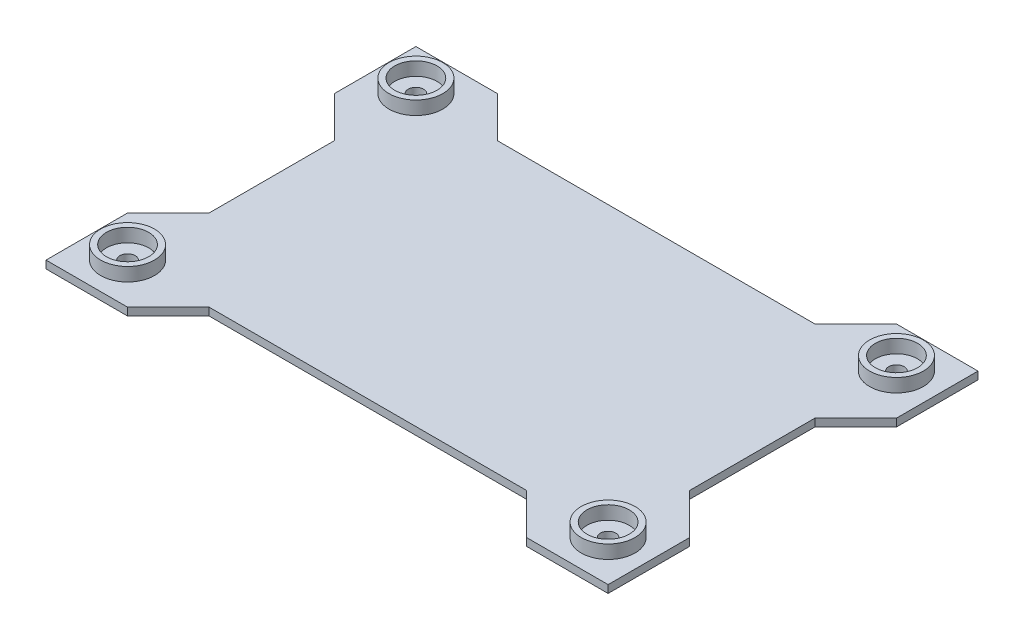
ISO-10303-21;
HEADER;
FILE_DESCRIPTION(('STEP AP214'),'2;1');
FILE_NAME('part.step','',(''),(''),'','','');
FILE_SCHEMA(('AUTOMOTIVE_DESIGN { 1 0 10303 214 1 1 1 1 }'));
ENDSEC;
DATA;
#1=APPLICATION_CONTEXT('core data for automotive mechanical design processes');
#2=APPLICATION_PROTOCOL_DEFINITION('international standard','automotive_design',2000,#1);
#3=PRODUCT_CONTEXT('',#1,'mechanical');
#4=PRODUCT('Part','Part','',(#3));
#5=PRODUCT_RELATED_PRODUCT_CATEGORY('part','',(#4));
#6=PRODUCT_DEFINITION_FORMATION('','',#4);
#7=PRODUCT_DEFINITION_CONTEXT('part definition',#1,'design');
#8=PRODUCT_DEFINITION('design','',#6,#7);
#9=PRODUCT_DEFINITION_SHAPE('','',#8);
#10=(LENGTH_UNIT() NAMED_UNIT(*) SI_UNIT(.MILLI.,.METRE.));
#11=(NAMED_UNIT(*) PLANE_ANGLE_UNIT() SI_UNIT($,.RADIAN.));
#12=(NAMED_UNIT(*) SI_UNIT($,.STERADIAN.) SOLID_ANGLE_UNIT());
#13=UNCERTAINTY_MEASURE_WITH_UNIT(LENGTH_MEASURE(1.E-05),#10,'distance_accuracy_value','');
#14=(GEOMETRIC_REPRESENTATION_CONTEXT(3) GLOBAL_UNCERTAINTY_ASSIGNED_CONTEXT((#13)) GLOBAL_UNIT_ASSIGNED_CONTEXT((#10,
#11,#12)) REPRESENTATION_CONTEXT('',''));
#15=CARTESIAN_POINT('',(0.,0.,0.));
#16=DIRECTION('',(0.,0.,1.));
#17=DIRECTION('',(1.,0.,0.));
#18=AXIS2_PLACEMENT_3D('',#15,#16,#17);
#19=CARTESIAN_POINT('',(0.,4.,0.));
#20=DIRECTION('',(0.,1.,0.));
#21=DIRECTION('',(0.,0.,1.));
#22=AXIS2_PLACEMENT_3D('',#19,#20,#21);
#23=PLANE('',#22);
#24=CARTESIAN_POINT('',(125.,4.,75.0000000000001));
#25=DIRECTION('',(0.,1.,0.));
#26=DIRECTION('',(0.,0.,-1.));
#27=AXIS2_PLACEMENT_3D('',#24,#25,#26);
#28=CIRCLE('',#27,4.00000000000001);
#29=CARTESIAN_POINT('',(125.,4.,71.0000000000001));
#30=VERTEX_POINT('',#29);
#31=EDGE_CURVE('E209',#30,#30,#28,.T.);
#32=ORIENTED_EDGE('',*,*,#31,.F.);
#33=EDGE_LOOP('',(#32));
#34=FACE_BOUND('',#33,.T.);
#35=CARTESIAN_POINT('',(125.,4.,75.0000000000001));
#36=DIRECTION('',(0.,1.,0.));
#37=DIRECTION('',(0.,0.,1.));
#38=AXIS2_PLACEMENT_3D('',#35,#36,#37);
#39=CIRCLE('',#38,11.);
#40=CARTESIAN_POINT('',(125.,4.,86.0000000000001));
#41=VERTEX_POINT('',#40);
#42=EDGE_CURVE('E11',#41,#41,#39,.F.);
#43=ORIENTED_EDGE('',*,*,#42,.F.);
#44=EDGE_LOOP('',(#43));
#45=FACE_BOUND('',#44,.T.);
#46=ADVANCED_FACE('F39',(#34,#45),#23,.T.);
#47=CARTESIAN_POINT('',(-125.,4.,75.0000000000001));
#48=DIRECTION('',(0.,-1.,0.));
#49=DIRECTION('',(0.,0.,-1.));
#50=AXIS2_PLACEMENT_3D('',#47,#48,#49);
#51=CIRCLE('',#50,4.00000000000001);
#52=CARTESIAN_POINT('',(-125.,4.,71.0000000000001));
#53=VERTEX_POINT('',#52);
#54=EDGE_CURVE('E244',#53,#53,#51,.T.);
#55=ORIENTED_EDGE('',*,*,#54,.T.);
#56=EDGE_LOOP('',(#55));
#57=FACE_BOUND('',#56,.T.);
#58=CARTESIAN_POINT('',(-125.,4.,75.0000000000001));
#59=DIRECTION('',(0.,-1.,0.));
#60=DIRECTION('',(0.,0.,-1.));
#61=AXIS2_PLACEMENT_3D('',#58,#59,#60);
#62=CIRCLE('',#61,11.);
#63=CARTESIAN_POINT('',(-125.,4.,64.0000000000001));
#64=VERTEX_POINT('',#63);
#65=EDGE_CURVE('E232',#64,#64,#62,.T.);
#66=ORIENTED_EDGE('',*,*,#65,.F.);
#67=EDGE_LOOP('',(#66));
#68=FACE_BOUND('',#67,.T.);
#69=ADVANCED_FACE('F499',(#57,#68),#23,.T.);
#70=CARTESIAN_POINT('',(-125.,4.,-75.));
#71=DIRECTION('',(1.,0.,0.));
#72=DIRECTION('',(0.,0.,-1.));
#73=AXIS2_PLACEMENT_3D('',#70,#71,#72);
#74=PLANE('',#73);
#75=DIRECTION('',(0.,1.,0.));
#76=VECTOR('',#75,1.);
#77=CARTESIAN_POINT('',(-125.,-89.9999999999999,32.5735931288077));
#78=LINE('',#77,#76);
#79=CARTESIAN_POINT('',(-125.,0.,32.5735931288077));
#80=VERTEX_POINT('',#79);
#81=CARTESIAN_POINT('',(-125.,4.,32.5735931288077));
#82=VERTEX_POINT('',#81);
#83=EDGE_CURVE('E286',#80,#82,#78,.T.);
#84=ORIENTED_EDGE('',*,*,#83,.T.);
#85=DIRECTION('',(0.,0.,1.));
#86=VECTOR('',#85,1.);
#87=CARTESIAN_POINT('',(-125.,4.,-75.));
#88=LINE('',#87,#86);
#89=CARTESIAN_POINT('',(-125.,4.,-32.5735931288077));
#90=VERTEX_POINT('',#89);
#91=EDGE_CURVE('E441',#90,#82,#88,.T.);
#92=ORIENTED_EDGE('',*,*,#91,.F.);
#93=DIRECTION('',(0.,1.,0.));
#94=VECTOR('',#93,1.);
#95=CARTESIAN_POINT('',(-125.,-89.9999999999999,-32.5735931288077));
#96=LINE('',#95,#94);
#97=CARTESIAN_POINT('',(-125.,0.,-32.5735931288077));
#98=VERTEX_POINT('',#97);
#99=EDGE_CURVE('E426',#98,#90,#96,.T.);
#100=ORIENTED_EDGE('',*,*,#99,.F.);
#101=DIRECTION('',(0.,0.,1.));
#102=VECTOR('',#101,1.);
#103=CARTESIAN_POINT('',(-125.,0.,-75.));
#104=LINE('',#103,#102);
#105=EDGE_CURVE('E454',#98,#80,#104,.T.);
#106=ORIENTED_EDGE('',*,*,#105,.T.);
#107=EDGE_LOOP('',(#84,#92,#100,#106));
#108=FACE_BOUND('',#107,.T.);
#109=ADVANCED_FACE('F504',(#108),#74,.F.);
#110=CARTESIAN_POINT('',(-125.,4.,75.));
#111=DIRECTION('',(0.,0.,-1.));
#112=DIRECTION('',(-1.,0.,0.));
#113=AXIS2_PLACEMENT_3D('',#110,#111,#112);
#114=PLANE('',#113);
#115=DIRECTION('',(1.,0.,0.));
#116=VECTOR('',#115,1.);
#117=CARTESIAN_POINT('',(-125.,0.,75.));
#118=LINE('',#117,#116);
#119=CARTESIAN_POINT('',(-82.5735931288068,0.,75.));
#120=VERTEX_POINT('',#119);
#121=CARTESIAN_POINT('',(82.5735931288068,0.,75.));
#122=VERTEX_POINT('',#121);
#123=EDGE_CURVE('E438',#120,#122,#118,.T.);
#124=ORIENTED_EDGE('',*,*,#123,.T.);
#125=DIRECTION('',(0.,1.,0.));
#126=VECTOR('',#125,1.);
#127=CARTESIAN_POINT('',(82.5735931288068,-89.9999999999999,75.));
#128=LINE('',#127,#126);
#129=CARTESIAN_POINT('',(82.5735931288068,4.,75.));
#130=VERTEX_POINT('',#129);
#131=EDGE_CURVE('E63',#122,#130,#128,.T.);
#132=ORIENTED_EDGE('',*,*,#131,.T.);
#133=DIRECTION('',(1.,0.,0.));
#134=VECTOR('',#133,1.);
#135=CARTESIAN_POINT('',(-125.,4.,75.));
#136=LINE('',#135,#134);
#137=CARTESIAN_POINT('',(-82.5735931288068,4.,75.));
#138=VERTEX_POINT('',#137);
#139=EDGE_CURVE('E445',#138,#130,#136,.T.);
#140=ORIENTED_EDGE('',*,*,#139,.F.);
#141=DIRECTION('',(0.,1.,0.));
#142=VECTOR('',#141,1.);
#143=CARTESIAN_POINT('',(-82.5735931288068,-89.9999999999999,75.));
#144=LINE('',#143,#142);
#145=EDGE_CURVE('E289',#120,#138,#144,.T.);
#146=ORIENTED_EDGE('',*,*,#145,.F.);
#147=EDGE_LOOP('',(#124,#132,#140,#146));
#148=FACE_BOUND('',#147,.T.);
#149=ADVANCED_FACE('F516',(#148),#114,.F.);
#150=CARTESIAN_POINT('',(125.,4.,-75.0000000000001));
#151=DIRECTION('',(0.,-1.,0.));
#152=DIRECTION('',(0.,0.,1.));
#153=AXIS2_PLACEMENT_3D('',#150,#151,#152);
#154=CIRCLE('',#153,4.00000000000001);
#155=CARTESIAN_POINT('',(125.,4.,-71.0000000000001));
#156=VERTEX_POINT('',#155);
#157=EDGE_CURVE('E312',#156,#156,#154,.T.);
#158=ORIENTED_EDGE('',*,*,#157,.T.);
#159=EDGE_LOOP('',(#158));
#160=FACE_BOUND('',#159,.T.);
#161=CARTESIAN_POINT('',(125.,4.,-75.0000000000001));
#162=DIRECTION('',(0.,-1.,0.));
#163=DIRECTION('',(0.,0.,1.));
#164=AXIS2_PLACEMENT_3D('',#161,#162,#163);
#165=CIRCLE('',#164,11.);
#166=CARTESIAN_POINT('',(125.,4.,-64.0000000000001));
#167=VERTEX_POINT('',#166);
#168=EDGE_CURVE('E266',#167,#167,#165,.T.);
#169=ORIENTED_EDGE('',*,*,#168,.F.);
#170=EDGE_LOOP('',(#169));
#171=FACE_BOUND('',#170,.T.);
#172=ADVANCED_FACE('F506',(#160,#171),#23,.T.);
#173=CARTESIAN_POINT('',(125.,4.,-75.));
#174=DIRECTION('',(-1.,0.,0.));
#175=DIRECTION('',(0.,0.,1.));
#176=AXIS2_PLACEMENT_3D('',#173,#174,#175);
#177=PLANE('',#176);
#178=DIRECTION('',(0.,0.,-1.));
#179=VECTOR('',#178,1.);
#180=CARTESIAN_POINT('',(125.,4.,-75.));
#181=LINE('',#180,#179);
#182=CARTESIAN_POINT('',(125.,4.,32.5735931288077));
#183=VERTEX_POINT('',#182);
#184=CARTESIAN_POINT('',(125.,4.,-32.5735931288077));
#185=VERTEX_POINT('',#184);
#186=EDGE_CURVE('E55',#183,#185,#181,.T.);
#187=ORIENTED_EDGE('',*,*,#186,.F.);
#188=DIRECTION('',(0.,1.,0.));
#189=VECTOR('',#188,1.);
#190=CARTESIAN_POINT('',(125.,-89.9999999999999,32.5735931288077));
#191=LINE('',#190,#189);
#192=CARTESIAN_POINT('',(125.,0.,32.5735931288077));
#193=VERTEX_POINT('',#192);
#194=EDGE_CURVE('E190',#193,#183,#191,.T.);
#195=ORIENTED_EDGE('',*,*,#194,.F.);
#196=DIRECTION('',(0.,0.,-1.));
#197=VECTOR('',#196,1.);
#198=CARTESIAN_POINT('',(125.,0.,-75.));
#199=LINE('',#198,#197);
#200=CARTESIAN_POINT('',(125.,0.,-32.5735931288077));
#201=VERTEX_POINT('',#200);
#202=EDGE_CURVE('E434',#193,#201,#199,.T.);
#203=ORIENTED_EDGE('',*,*,#202,.T.);
#204=DIRECTION('',(0.,1.,0.));
#205=VECTOR('',#204,1.);
#206=CARTESIAN_POINT('',(125.,-89.9999999999999,-32.5735931288077));
#207=LINE('',#206,#205);
#208=EDGE_CURVE('E354',#201,#185,#207,.T.);
#209=ORIENTED_EDGE('',*,*,#208,.T.);
#210=EDGE_LOOP('',(#187,#195,#203,#209));
#211=FACE_BOUND('',#210,.T.);
#212=ADVANCED_FACE('F41',(#211),#177,.F.);
#213=CARTESIAN_POINT('',(-125.,4.,-75.));
#214=DIRECTION('',(0.,0.,1.));
#215=DIRECTION('',(1.,0.,0.));
#216=AXIS2_PLACEMENT_3D('',#213,#214,#215);
#217=PLANE('',#216);
#218=DIRECTION('',(0.,1.,0.));
#219=VECTOR('',#218,1.);
#220=CARTESIAN_POINT('',(82.5735931288068,-89.9999999999999,-75.));
#221=LINE('',#220,#219);
#222=CARTESIAN_POINT('',(82.5735931288068,0.,-75.));
#223=VERTEX_POINT('',#222);
#224=CARTESIAN_POINT('',(82.5735931288068,4.,-75.));
#225=VERTEX_POINT('',#224);
#226=EDGE_CURVE('E357',#223,#225,#221,.T.);
#227=ORIENTED_EDGE('',*,*,#226,.F.);
#228=DIRECTION('',(-1.,0.,0.));
#229=VECTOR('',#228,1.);
#230=CARTESIAN_POINT('',(-125.,0.,-75.));
#231=LINE('',#230,#229);
#232=CARTESIAN_POINT('',(-82.5735931288068,0.,-75.));
#233=VERTEX_POINT('',#232);
#234=EDGE_CURVE('E451',#223,#233,#231,.T.);
#235=ORIENTED_EDGE('',*,*,#234,.T.);
#236=DIRECTION('',(0.,1.,0.));
#237=VECTOR('',#236,1.);
#238=CARTESIAN_POINT('',(-82.5735931288068,-89.9999999999999,-75.));
#239=LINE('',#238,#237);
#240=CARTESIAN_POINT('',(-82.5735931288068,4.,-75.));
#241=VERTEX_POINT('',#240);
#242=EDGE_CURVE('E422',#233,#241,#239,.T.);
#243=ORIENTED_EDGE('',*,*,#242,.T.);
#244=DIRECTION('',(-1.,0.,0.));
#245=VECTOR('',#244,1.);
#246=CARTESIAN_POINT('',(-125.,4.,-75.));
#247=LINE('',#246,#245);
#248=EDGE_CURVE('E437',#225,#241,#247,.T.);
#249=ORIENTED_EDGE('',*,*,#248,.F.);
#250=EDGE_LOOP('',(#227,#235,#243,#249));
#251=FACE_BOUND('',#250,.T.);
#252=ADVANCED_FACE('F521',(#251),#217,.F.);
#253=CARTESIAN_POINT('',(-125.,4.,-75.0000000000001));
#254=DIRECTION('',(0.,1.,0.));
#255=DIRECTION('',(0.,0.,1.));
#256=AXIS2_PLACEMENT_3D('',#253,#254,#255);
#257=CIRCLE('',#256,4.00000000000001);
#258=CARTESIAN_POINT('',(-125.,4.,-71.0000000000001));
#259=VERTEX_POINT('',#258);
#260=EDGE_CURVE('E377',#259,#259,#257,.T.);
#261=ORIENTED_EDGE('',*,*,#260,.F.);
#262=EDGE_LOOP('',(#261));
#263=FACE_BOUND('',#262,.T.);
#264=CARTESIAN_POINT('',(-125.,4.,-75.0000000000001));
#265=DIRECTION('',(0.,1.,0.));
#266=DIRECTION('',(0.,0.,1.));
#267=AXIS2_PLACEMENT_3D('',#264,#265,#266);
#268=CIRCLE('',#267,11.);
#269=CARTESIAN_POINT('',(-125.,4.,-64.0000000000001));
#270=VERTEX_POINT('',#269);
#271=EDGE_CURVE('E448',#270,#270,#268,.F.);
#272=ORIENTED_EDGE('',*,*,#271,.F.);
#273=EDGE_LOOP('',(#272));
#274=FACE_BOUND('',#273,.T.);
#275=ADVANCED_FACE('F473',(#263,#274),#23,.T.);
#276=CARTESIAN_POINT('',(125.,4.,75.0000000000001));
#277=DIRECTION('',(0.,1.,0.));
#278=DIRECTION('',(0.,0.,-1.));
#279=AXIS2_PLACEMENT_3D('',#276,#277,#278);
#280=CIRCLE('',#279,14.);
#281=CARTESIAN_POINT('',(125.,4.,61.0000000000001));
#282=VERTEX_POINT('',#281);
#283=EDGE_CURVE('E605',#282,#282,#280,.T.);
#284=ORIENTED_EDGE('',*,*,#283,.F.);
#285=EDGE_LOOP('',(#284));
#286=FACE_BOUND('',#285,.T.);
#287=ORIENTED_EDGE('',*,*,#139,.T.);
#288=DIRECTION('',(0.707106781186549,0.,0.707106781186546));
#289=VECTOR('',#288,1.);
#290=CARTESIAN_POINT('',(103.786796564403,4.,96.2132034355965));
#291=LINE('',#290,#289);
#292=CARTESIAN_POINT('',(103.786796564403,4.,96.2132034355965));
#293=VERTEX_POINT('',#292);
#294=EDGE_CURVE('E198',#130,#293,#291,.T.);
#295=ORIENTED_EDGE('',*,*,#294,.T.);
#296=DIRECTION('',(1.,0.,0.));
#297=VECTOR('',#296,1.);
#298=CARTESIAN_POINT('',(146.213203435596,4.,96.2132034355965));
#299=LINE('',#298,#297);
#300=CARTESIAN_POINT('',(146.213203435596,4.,96.2132034355965));
#301=VERTEX_POINT('',#300);
#302=EDGE_CURVE('E191',#293,#301,#299,.T.);
#303=ORIENTED_EDGE('',*,*,#302,.T.);
#304=DIRECTION('',(0.,0.,-1.));
#305=VECTOR('',#304,1.);
#306=CARTESIAN_POINT('',(146.213203435596,4.,96.2132034355965));
#307=LINE('',#306,#305);
#308=CARTESIAN_POINT('',(146.213203435596,4.,53.7867965644037));
#309=VERTEX_POINT('',#308);
#310=EDGE_CURVE('E184',#301,#309,#307,.T.);
#311=ORIENTED_EDGE('',*,*,#310,.T.);
#312=DIRECTION('',(-0.707106781186551,0.,-0.707106781186543));
#313=VECTOR('',#312,1.);
#314=CARTESIAN_POINT('',(146.213203435596,4.,53.7867965644037));
#315=LINE('',#314,#313);
#316=EDGE_CURVE('E194',#309,#183,#315,.T.);
#317=ORIENTED_EDGE('',*,*,#316,.T.);
#318=ORIENTED_EDGE('',*,*,#186,.T.);
#319=DIRECTION('',(-0.707106781186551,0.,0.707106781186543));
#320=VECTOR('',#319,1.);
#321=CARTESIAN_POINT('',(146.213203435596,4.,-53.7867965644037));
#322=LINE('',#321,#320);
#323=CARTESIAN_POINT('',(146.213203435596,4.,-53.7867965644037));
#324=VERTEX_POINT('',#323);
#325=EDGE_CURVE('E346',#324,#185,#322,.T.);
#326=ORIENTED_EDGE('',*,*,#325,.F.);
#327=DIRECTION('',(0.,0.,1.));
#328=VECTOR('',#327,1.);
#329=CARTESIAN_POINT('',(146.213203435596,4.,-96.2132034355965));
#330=LINE('',#329,#328);
#331=CARTESIAN_POINT('',(146.213203435596,4.,-96.2132034355965));
#332=VERTEX_POINT('',#331);
#333=EDGE_CURVE('E317',#332,#324,#330,.T.);
#334=ORIENTED_EDGE('',*,*,#333,.F.);
#335=DIRECTION('',(1.,0.,0.));
#336=VECTOR('',#335,1.);
#337=CARTESIAN_POINT('',(146.213203435596,4.,-96.2132034355965));
#338=LINE('',#337,#336);
#339=CARTESIAN_POINT('',(103.786796564403,4.,-96.2132034355965));
#340=VERTEX_POINT('',#339);
#341=EDGE_CURVE('E338',#340,#332,#338,.T.);
#342=ORIENTED_EDGE('',*,*,#341,.F.);
#343=DIRECTION('',(0.707106781186549,0.,-0.707106781186546));
#344=VECTOR('',#343,1.);
#345=CARTESIAN_POINT('',(103.786796564403,4.,-96.2132034355965));
#346=LINE('',#345,#344);
#347=EDGE_CURVE('E342',#225,#340,#346,.T.);
#348=ORIENTED_EDGE('',*,*,#347,.F.);
#349=ORIENTED_EDGE('',*,*,#248,.T.);
#350=DIRECTION('',(-0.707106781186549,0.,-0.707106781186546));
#351=VECTOR('',#350,1.);
#352=CARTESIAN_POINT('',(-103.786796564403,4.,-96.2132034355965));
#353=LINE('',#352,#351);
#354=CARTESIAN_POINT('',(-103.786796564403,4.,-96.2132034355965));
#355=VERTEX_POINT('',#354);
#356=EDGE_CURVE('E408',#241,#355,#353,.T.);
#357=ORIENTED_EDGE('',*,*,#356,.T.);
#358=DIRECTION('',(-1.,0.,0.));
#359=VECTOR('',#358,1.);
#360=CARTESIAN_POINT('',(-146.213203435596,4.,-96.2132034355965));
#361=LINE('',#360,#359);
#362=CARTESIAN_POINT('',(-146.213203435596,4.,-96.2132034355965));
#363=VERTEX_POINT('',#362);
#364=EDGE_CURVE('E412',#355,#363,#361,.T.);
#365=ORIENTED_EDGE('',*,*,#364,.T.);
#366=DIRECTION('',(0.,0.,1.));
#367=VECTOR('',#366,1.);
#368=CARTESIAN_POINT('',(-146.213203435596,4.,-96.2132034355965));
#369=LINE('',#368,#367);
#370=CARTESIAN_POINT('',(-146.213203435596,4.,-53.7867965644037));
#371=VERTEX_POINT('',#370);
#372=EDGE_CURVE('E385',#363,#371,#369,.T.);
#373=ORIENTED_EDGE('',*,*,#372,.T.);
#374=DIRECTION('',(0.707106781186551,0.,0.707106781186543));
#375=VECTOR('',#374,1.);
#376=CARTESIAN_POINT('',(-146.213203435596,4.,-53.7867965644037));
#377=LINE('',#376,#375);
#378=EDGE_CURVE('E404',#371,#90,#377,.T.);
#379=ORIENTED_EDGE('',*,*,#378,.T.);
#380=ORIENTED_EDGE('',*,*,#91,.T.);
#381=DIRECTION('',(0.707106781186551,0.,-0.707106781186543));
#382=VECTOR('',#381,1.);
#383=CARTESIAN_POINT('',(-146.213203435596,4.,53.7867965644037));
#384=LINE('',#383,#382);
#385=CARTESIAN_POINT('',(-146.213203435596,4.,53.7867965644037));
#386=VERTEX_POINT('',#385);
#387=EDGE_CURVE('E278',#386,#82,#384,.T.);
#388=ORIENTED_EDGE('',*,*,#387,.F.);
#389=DIRECTION('',(0.,0.,-1.));
#390=VECTOR('',#389,1.);
#391=CARTESIAN_POINT('',(-146.213203435596,4.,96.2132034355965));
#392=LINE('',#391,#390);
#393=CARTESIAN_POINT('',(-146.213203435596,4.,96.2132034355965));
#394=VERTEX_POINT('',#393);
#395=EDGE_CURVE('E249',#394,#386,#392,.T.);
#396=ORIENTED_EDGE('',*,*,#395,.F.);
#397=DIRECTION('',(-1.,0.,0.));
#398=VECTOR('',#397,1.);
#399=CARTESIAN_POINT('',(-146.213203435596,4.,96.2132034355965));
#400=LINE('',#399,#398);
#401=CARTESIAN_POINT('',(-103.786796564403,4.,96.2132034355965));
#402=VERTEX_POINT('',#401);
#403=EDGE_CURVE('E270',#402,#394,#400,.T.);
#404=ORIENTED_EDGE('',*,*,#403,.F.);
#405=DIRECTION('',(-0.707106781186549,0.,0.707106781186546));
#406=VECTOR('',#405,1.);
#407=CARTESIAN_POINT('',(-103.786796564403,4.,96.2132034355965));
#408=LINE('',#407,#406);
#409=EDGE_CURVE('E274',#138,#402,#408,.T.);
#410=ORIENTED_EDGE('',*,*,#409,.F.);
#411=EDGE_LOOP('',(#287,#295,#303,#311,#317,#318,#326,#334,#342,#348,#349,#357,#365,#373,#379,
#380,#388,#396,#404,#410));
#412=FACE_BOUND('',#411,.T.);
#413=CARTESIAN_POINT('',(-125.,4.,75.0000000000001));
#414=DIRECTION('',(0.,1.,0.));
#415=DIRECTION('',(0.,0.,1.));
#416=AXIS2_PLACEMENT_3D('',#413,#414,#415);
#417=CIRCLE('',#416,14.);
#418=CARTESIAN_POINT('',(-125.,4.,89.0000000000001));
#419=VERTEX_POINT('',#418);
#420=EDGE_CURVE('E48',#419,#419,#417,.T.);
#421=ORIENTED_EDGE('',*,*,#420,.F.);
#422=EDGE_LOOP('',(#421));
#423=FACE_BOUND('',#422,.T.);
#424=CARTESIAN_POINT('',(125.,4.,-75.0000000000001));
#425=DIRECTION('',(0.,1.,0.));
#426=DIRECTION('',(0.,0.,1.));
#427=AXIS2_PLACEMENT_3D('',#424,#425,#426);
#428=CIRCLE('',#427,14.);
#429=CARTESIAN_POINT('',(125.,4.,-61.0000000000001));
#430=VERTEX_POINT('',#429);
#431=EDGE_CURVE('E462',#430,#430,#428,.T.);
#432=ORIENTED_EDGE('',*,*,#431,.F.);
#433=EDGE_LOOP('',(#432));
#434=FACE_BOUND('',#433,.T.);
#435=CARTESIAN_POINT('',(-125.,4.,-75.0000000000001));
#436=DIRECTION('',(0.,1.,0.));
#437=DIRECTION('',(0.,0.,1.));
#438=AXIS2_PLACEMENT_3D('',#435,#436,#437);
#439=CIRCLE('',#438,14.);
#440=CARTESIAN_POINT('',(-125.,4.,-61.0000000000001));
#441=VERTEX_POINT('',#440);
#442=EDGE_CURVE('E372',#441,#441,#439,.T.);
#443=ORIENTED_EDGE('',*,*,#442,.F.);
#444=EDGE_LOOP('',(#443));
#445=FACE_BOUND('',#444,.T.);
#446=ADVANCED_FACE('F200',(#286,#412,#423,#434,#445),#23,.T.);
#447=CARTESIAN_POINT('',(0.,0.,0.));
#448=DIRECTION('',(0.,1.,0.));
#449=DIRECTION('',(0.,0.,1.));
#450=AXIS2_PLACEMENT_3D('',#447,#448,#449);
#451=PLANE('',#450);
#452=CARTESIAN_POINT('',(125.,0.,75.0000000000001));
#453=DIRECTION('',(0.,1.,0.));
#454=DIRECTION('',(0.,0.,-1.));
#455=AXIS2_PLACEMENT_3D('',#452,#453,#454);
#456=CIRCLE('',#455,4.00000000000001);
#457=CARTESIAN_POINT('',(125.,0.,71.0000000000001));
#458=VERTEX_POINT('',#457);
#459=EDGE_CURVE('E205',#458,#458,#456,.T.);
#460=ORIENTED_EDGE('',*,*,#459,.T.);
#461=EDGE_LOOP('',(#460));
#462=FACE_BOUND('',#461,.T.);
#463=CARTESIAN_POINT('',(-125.,0.,75.0000000000001));
#464=DIRECTION('',(0.,-1.,0.));
#465=DIRECTION('',(0.,0.,-1.));
#466=AXIS2_PLACEMENT_3D('',#463,#464,#465);
#467=CIRCLE('',#466,4.00000000000001);
#468=CARTESIAN_POINT('',(-125.,0.,71.0000000000001));
#469=VERTEX_POINT('',#468);
#470=EDGE_CURVE('E245',#469,#469,#467,.T.);
#471=ORIENTED_EDGE('',*,*,#470,.F.);
#472=EDGE_LOOP('',(#471));
#473=FACE_BOUND('',#472,.T.);
#474=ORIENTED_EDGE('',*,*,#123,.F.);
#475=DIRECTION('',(0.707106781186549,0.,-0.707106781186546));
#476=VECTOR('',#475,1.);
#477=CARTESIAN_POINT('',(-103.786796564403,0.,96.2132034355965));
#478=LINE('',#477,#476);
#479=CARTESIAN_POINT('',(-103.786796564403,0.,96.2132034355965));
#480=VERTEX_POINT('',#479);
#481=EDGE_CURVE('E253',#480,#120,#478,.T.);
#482=ORIENTED_EDGE('',*,*,#481,.F.);
#483=DIRECTION('',(1.,0.,0.));
#484=VECTOR('',#483,1.);
#485=CARTESIAN_POINT('',(-146.213203435596,0.,96.2132034355965));
#486=LINE('',#485,#484);
#487=CARTESIAN_POINT('',(-146.213203435596,0.,96.2132034355965));
#488=VERTEX_POINT('',#487);
#489=EDGE_CURVE('E258',#488,#480,#486,.T.);
#490=ORIENTED_EDGE('',*,*,#489,.F.);
#491=DIRECTION('',(0.,0.,1.));
#492=VECTOR('',#491,1.);
#493=CARTESIAN_POINT('',(-146.213203435596,0.,96.2132034355965));
#494=LINE('',#493,#492);
#495=CARTESIAN_POINT('',(-146.213203435596,0.,53.7867965644037));
#496=VERTEX_POINT('',#495);
#497=EDGE_CURVE('E262',#496,#488,#494,.T.);
#498=ORIENTED_EDGE('',*,*,#497,.F.);
#499=DIRECTION('',(-0.707106781186551,0.,0.707106781186544));
#500=VECTOR('',#499,1.);
#501=CARTESIAN_POINT('',(-146.213203435596,0.,53.7867965644037));
#502=LINE('',#501,#500);
#503=EDGE_CURVE('E257',#80,#496,#502,.T.);
#504=ORIENTED_EDGE('',*,*,#503,.F.);
#505=ORIENTED_EDGE('',*,*,#105,.F.);
#506=DIRECTION('',(-0.707106781186551,0.,-0.707106781186544));
#507=VECTOR('',#506,1.);
#508=CARTESIAN_POINT('',(-146.213203435596,0.,-53.7867965644037));
#509=LINE('',#508,#507);
#510=CARTESIAN_POINT('',(-146.213203435596,0.,-53.7867965644037));
#511=VERTEX_POINT('',#510);
#512=EDGE_CURVE('E400',#98,#511,#509,.T.);
#513=ORIENTED_EDGE('',*,*,#512,.T.);
#514=DIRECTION('',(0.,0.,-1.));
#515=VECTOR('',#514,1.);
#516=CARTESIAN_POINT('',(-146.213203435596,0.,-96.2132034355965));
#517=LINE('',#516,#515);
#518=CARTESIAN_POINT('',(-146.213203435596,0.,-96.2132034355965));
#519=VERTEX_POINT('',#518);
#520=EDGE_CURVE('E397',#511,#519,#517,.T.);
#521=ORIENTED_EDGE('',*,*,#520,.T.);
#522=DIRECTION('',(1.,0.,0.));
#523=VECTOR('',#522,1.);
#524=CARTESIAN_POINT('',(-146.213203435596,0.,-96.2132034355965));
#525=LINE('',#524,#523);
#526=CARTESIAN_POINT('',(-103.786796564403,0.,-96.2132034355965));
#527=VERTEX_POINT('',#526);
#528=EDGE_CURVE('E393',#519,#527,#525,.T.);
#529=ORIENTED_EDGE('',*,*,#528,.T.);
#530=DIRECTION('',(0.707106781186549,0.,0.707106781186546));
#531=VECTOR('',#530,1.);
#532=CARTESIAN_POINT('',(-103.786796564403,0.,-96.2132034355965));
#533=LINE('',#532,#531);
#534=EDGE_CURVE('E389',#527,#233,#533,.T.);
#535=ORIENTED_EDGE('',*,*,#534,.T.);
#536=ORIENTED_EDGE('',*,*,#234,.F.);
#537=DIRECTION('',(-0.707106781186549,0.,0.707106781186546));
#538=VECTOR('',#537,1.);
#539=CARTESIAN_POINT('',(103.786796564403,0.,-96.2132034355965));
#540=LINE('',#539,#538);
#541=CARTESIAN_POINT('',(103.786796564403,0.,-96.2132034355965));
#542=VERTEX_POINT('',#541);
#543=EDGE_CURVE('E321',#542,#223,#540,.T.);
#544=ORIENTED_EDGE('',*,*,#543,.F.);
#545=DIRECTION('',(-1.,0.,0.));
#546=VECTOR('',#545,1.);
#547=CARTESIAN_POINT('',(146.213203435596,0.,-96.2132034355965));
#548=LINE('',#547,#546);
#549=CARTESIAN_POINT('',(146.213203435596,0.,-96.2132034355965));
#550=VERTEX_POINT('',#549);
#551=EDGE_CURVE('E326',#550,#542,#548,.T.);
#552=ORIENTED_EDGE('',*,*,#551,.F.);
#553=DIRECTION('',(0.,0.,-1.));
#554=VECTOR('',#553,1.);
#555=CARTESIAN_POINT('',(146.213203435596,0.,-96.2132034355965));
#556=LINE('',#555,#554);
#557=CARTESIAN_POINT('',(146.213203435596,0.,-53.7867965644037));
#558=VERTEX_POINT('',#557);
#559=EDGE_CURVE('E330',#558,#550,#556,.T.);
#560=ORIENTED_EDGE('',*,*,#559,.F.);
#561=DIRECTION('',(0.707106781186551,0.,-0.707106781186544));
#562=VECTOR('',#561,1.);
#563=CARTESIAN_POINT('',(146.213203435596,0.,-53.7867965644037));
#564=LINE('',#563,#562);
#565=EDGE_CURVE('E325',#201,#558,#564,.T.);
#566=ORIENTED_EDGE('',*,*,#565,.F.);
#567=ORIENTED_EDGE('',*,*,#202,.F.);
#568=DIRECTION('',(0.707106781186551,0.,0.707106781186544));
#569=VECTOR('',#568,1.);
#570=CARTESIAN_POINT('',(146.213203435596,0.,53.7867965644037));
#571=LINE('',#570,#569);
#572=CARTESIAN_POINT('',(146.213203435596,0.,53.7867965644037));
#573=VERTEX_POINT('',#572);
#574=EDGE_CURVE('E229',#193,#573,#571,.T.);
#575=ORIENTED_EDGE('',*,*,#574,.T.);
#576=DIRECTION('',(0.,0.,1.));
#577=VECTOR('',#576,1.);
#578=CARTESIAN_POINT('',(146.213203435596,0.,96.2132034355965));
#579=LINE('',#578,#577);
#580=CARTESIAN_POINT('',(146.213203435596,0.,96.2132034355965));
#581=VERTEX_POINT('',#580);
#582=EDGE_CURVE('E186',#573,#581,#579,.T.);
#583=ORIENTED_EDGE('',*,*,#582,.T.);
#584=DIRECTION('',(-1.,0.,0.));
#585=VECTOR('',#584,1.);
#586=CARTESIAN_POINT('',(146.213203435596,0.,96.2132034355965));
#587=LINE('',#586,#585);
#588=CARTESIAN_POINT('',(103.786796564403,0.,96.2132034355965));
#589=VERTEX_POINT('',#588);
#590=EDGE_CURVE('E589',#581,#589,#587,.T.);
#591=ORIENTED_EDGE('',*,*,#590,.T.);
#592=DIRECTION('',(-0.707106781186549,0.,-0.707106781186546));
#593=VECTOR('',#592,1.);
#594=CARTESIAN_POINT('',(103.786796564403,0.,96.2132034355965));
#595=LINE('',#594,#593);
#596=EDGE_CURVE('E221',#589,#122,#595,.T.);
#597=ORIENTED_EDGE('',*,*,#596,.T.);
#598=EDGE_LOOP('',(#474,#482,#490,#498,#504,#505,#513,#521,#529,#535,#536,#544,#552,#560,#566,
#567,#575,#583,#591,#597));
#599=FACE_BOUND('',#598,.T.);
#600=CARTESIAN_POINT('',(125.,0.,-75.0000000000001));
#601=DIRECTION('',(0.,-1.,0.));
#602=DIRECTION('',(0.,0.,1.));
#603=AXIS2_PLACEMENT_3D('',#600,#601,#602);
#604=CIRCLE('',#603,4.00000000000001);
#605=CARTESIAN_POINT('',(125.,0.,-71.0000000000001));
#606=VERTEX_POINT('',#605);
#607=EDGE_CURVE('E313',#606,#606,#604,.T.);
#608=ORIENTED_EDGE('',*,*,#607,.F.);
#609=EDGE_LOOP('',(#608));
#610=FACE_BOUND('',#609,.T.);
#611=CARTESIAN_POINT('',(-125.,0.,-75.0000000000001));
#612=DIRECTION('',(0.,1.,0.));
#613=DIRECTION('',(0.,0.,1.));
#614=AXIS2_PLACEMENT_3D('',#611,#612,#613);
#615=CIRCLE('',#614,4.00000000000001);
#616=CARTESIAN_POINT('',(-125.,0.,-71.0000000000001));
#617=VERTEX_POINT('',#616);
#618=EDGE_CURVE('E381',#617,#617,#615,.T.);
#619=ORIENTED_EDGE('',*,*,#618,.T.);
#620=EDGE_LOOP('',(#619));
#621=FACE_BOUND('',#620,.T.);
#622=ADVANCED_FACE('F472',(#462,#473,#599,#610,#621),#451,.F.);
#623=CARTESIAN_POINT('',(-146.213203435596,-89.9999999999999,-96.2132034355965));
#624=DIRECTION('',(-1.,0.,0.));
#625=DIRECTION('',(0.,0.,1.));
#626=AXIS2_PLACEMENT_3D('',#623,#624,#625);
#627=PLANE('',#626);
#628=ORIENTED_EDGE('',*,*,#520,.F.);
#629=DIRECTION('',(0.,1.,0.));
#630=VECTOR('',#629,1.);
#631=CARTESIAN_POINT('',(-146.213203435596,-89.9999999999999,-53.7867965644037));
#632=LINE('',#631,#630);
#633=EDGE_CURVE('E416',#511,#371,#632,.T.);
#634=ORIENTED_EDGE('',*,*,#633,.T.);
#635=ORIENTED_EDGE('',*,*,#372,.F.);
#636=DIRECTION('',(0.,1.,0.));
#637=VECTOR('',#636,1.);
#638=CARTESIAN_POINT('',(-146.213203435596,-89.9999999999999,-96.2132034355965));
#639=LINE('',#638,#637);
#640=EDGE_CURVE('E394',#519,#363,#639,.T.);
#641=ORIENTED_EDGE('',*,*,#640,.F.);
#642=EDGE_LOOP('',(#628,#634,#635,#641));
#643=FACE_BOUND('',#642,.T.);
#644=ADVANCED_FACE('F511',(#643),#627,.T.);
#645=CARTESIAN_POINT('',(-146.213203435596,-89.9999999999999,-96.2132034355965));
#646=DIRECTION('',(0.,0.,-1.));
#647=DIRECTION('',(-1.,0.,0.));
#648=AXIS2_PLACEMENT_3D('',#645,#646,#647);
#649=PLANE('',#648);
#650=ORIENTED_EDGE('',*,*,#528,.F.);
#651=ORIENTED_EDGE('',*,*,#640,.T.);
#652=ORIENTED_EDGE('',*,*,#364,.F.);
#653=DIRECTION('',(0.,1.,0.));
#654=VECTOR('',#653,1.);
#655=CARTESIAN_POINT('',(-103.786796564403,-89.9999999999999,-96.2132034355965));
#656=LINE('',#655,#654);
#657=EDGE_CURVE('E419',#527,#355,#656,.T.);
#658=ORIENTED_EDGE('',*,*,#657,.F.);
#659=EDGE_LOOP('',(#650,#651,#652,#658));
#660=FACE_BOUND('',#659,.T.);
#661=ADVANCED_FACE('F558',(#660),#649,.T.);
#662=CARTESIAN_POINT('',(-103.786796564403,-89.9999999999999,-96.2132034355965));
#663=DIRECTION('',(0.707106781186546,0.,-0.707106781186549));
#664=DIRECTION('',(-0.707106781186549,0.,-0.707106781186546));
#665=AXIS2_PLACEMENT_3D('',#662,#663,#664);
#666=PLANE('',#665);
#667=ORIENTED_EDGE('',*,*,#534,.F.);
#668=ORIENTED_EDGE('',*,*,#657,.T.);
#669=ORIENTED_EDGE('',*,*,#356,.F.);
#670=ORIENTED_EDGE('',*,*,#242,.F.);
#671=EDGE_LOOP('',(#667,#668,#669,#670));
#672=FACE_BOUND('',#671,.T.);
#673=ADVANCED_FACE('F554',(#672),#666,.T.);
#674=CARTESIAN_POINT('',(-146.213203435596,-89.9999999999999,-53.7867965644037));
#675=DIRECTION('',(-0.707106781186544,0.,0.707106781186551));
#676=DIRECTION('',(0.707106781186551,0.,0.707106781186544));
#677=AXIS2_PLACEMENT_3D('',#674,#675,#676);
#678=PLANE('',#677);
#679=ORIENTED_EDGE('',*,*,#512,.F.);
#680=ORIENTED_EDGE('',*,*,#99,.T.);
#681=ORIENTED_EDGE('',*,*,#378,.F.);
#682=ORIENTED_EDGE('',*,*,#633,.F.);
#683=EDGE_LOOP('',(#679,#680,#681,#682));
#684=FACE_BOUND('',#683,.T.);
#685=ADVANCED_FACE('F567',(#684),#678,.T.);
#686=CARTESIAN_POINT('',(-125.,0.,-75.0000000000001));
#687=DIRECTION('',(0.,1.,0.));
#688=DIRECTION('',(0.,0.,1.));
#689=AXIS2_PLACEMENT_3D('',#686,#687,#688);
#690=CYLINDRICAL_SURFACE('',#689,4.00000000000001);
#691=ORIENTED_EDGE('',*,*,#618,.F.);
#692=EDGE_LOOP('',(#691));
#693=FACE_BOUND('',#692,.T.);
#694=ORIENTED_EDGE('',*,*,#260,.T.);
#695=EDGE_LOOP('',(#694));
#696=FACE_BOUND('',#695,.T.);
#697=ADVANCED_FACE('F493',(#693,#696),#690,.F.);
#698=CARTESIAN_POINT('',(-125.,11.,-75.0000000000001));
#699=DIRECTION('',(0.,1.,0.));
#700=DIRECTION('',(0.,0.,1.));
#701=AXIS2_PLACEMENT_3D('',#698,#699,#700);
#702=PLANE('',#701);
#703=CARTESIAN_POINT('',(-125.,11.,-75.0000000000001));
#704=DIRECTION('',(0.,1.,0.));
#705=DIRECTION('',(0.,0.,1.));
#706=AXIS2_PLACEMENT_3D('',#703,#704,#705);
#707=CIRCLE('',#706,14.);
#708=CARTESIAN_POINT('',(-125.,11.,-61.0000000000001));
#709=VERTEX_POINT('',#708);
#710=EDGE_CURVE('E373',#709,#709,#707,.T.);
#711=ORIENTED_EDGE('',*,*,#710,.T.);
#712=EDGE_LOOP('',(#711));
#713=FACE_BOUND('',#712,.T.);
#714=CARTESIAN_POINT('',(-125.,11.,-75.0000000000001));
#715=DIRECTION('',(0.,1.,0.));
#716=DIRECTION('',(0.,0.,1.));
#717=AXIS2_PLACEMENT_3D('',#714,#715,#716);
#718=CIRCLE('',#717,11.);
#719=CARTESIAN_POINT('',(-125.,11.,-64.0000000000001));
#720=VERTEX_POINT('',#719);
#721=EDGE_CURVE('E334',#720,#720,#718,.T.);
#722=ORIENTED_EDGE('',*,*,#721,.F.);
#723=EDGE_LOOP('',(#722));
#724=FACE_BOUND('',#723,.T.);
#725=ADVANCED_FACE('F483',(#713,#724),#702,.T.);
#726=CARTESIAN_POINT('',(-125.,11.,-75.0000000000001));
#727=DIRECTION('',(0.,-1.,0.));
#728=DIRECTION('',(0.,0.,-1.));
#729=AXIS2_PLACEMENT_3D('',#726,#727,#728);
#730=CYLINDRICAL_SURFACE('',#729,14.);
#731=ORIENTED_EDGE('',*,*,#710,.F.);
#732=EDGE_LOOP('',(#731));
#733=FACE_BOUND('',#732,.T.);
#734=ORIENTED_EDGE('',*,*,#442,.T.);
#735=EDGE_LOOP('',(#734));
#736=FACE_BOUND('',#735,.T.);
#737=ADVANCED_FACE('F480',(#733,#736),#730,.T.);
#738=CARTESIAN_POINT('',(-125.,11.,-75.0000000000001));
#739=DIRECTION('',(0.,-1.,0.));
#740=DIRECTION('',(0.,0.,-1.));
#741=AXIS2_PLACEMENT_3D('',#738,#739,#740);
#742=CYLINDRICAL_SURFACE('',#741,11.);
#743=ORIENTED_EDGE('',*,*,#721,.T.);
#744=EDGE_LOOP('',(#743));
#745=FACE_BOUND('',#744,.T.);
#746=ORIENTED_EDGE('',*,*,#271,.T.);
#747=EDGE_LOOP('',(#746));
#748=FACE_BOUND('',#747,.T.);
#749=ADVANCED_FACE('F482',(#745,#748),#742,.F.);
#750=CARTESIAN_POINT('',(146.213203435596,-89.9999999999999,-96.2132034355965));
#751=DIRECTION('',(0.,0.,1.));
#752=DIRECTION('',(1.,0.,0.));
#753=AXIS2_PLACEMENT_3D('',#750,#751,#752);
#754=PLANE('',#753);
#755=DIRECTION('',(0.,1.,0.));
#756=VECTOR('',#755,1.);
#757=CARTESIAN_POINT('',(146.213203435596,-89.9999999999999,-96.2132034355965));
#758=LINE('',#757,#756);
#759=EDGE_CURVE('E350',#550,#332,#758,.T.);
#760=ORIENTED_EDGE('',*,*,#759,.F.);
#761=ORIENTED_EDGE('',*,*,#551,.T.);
#762=DIRECTION('',(0.,1.,0.));
#763=VECTOR('',#762,1.);
#764=CARTESIAN_POINT('',(103.786796564403,-89.9999999999999,-96.2132034355965));
#765=LINE('',#764,#763);
#766=EDGE_CURVE('E361',#542,#340,#765,.T.);
#767=ORIENTED_EDGE('',*,*,#766,.T.);
#768=ORIENTED_EDGE('',*,*,#341,.T.);
#769=EDGE_LOOP('',(#760,#761,#767,#768));
#770=FACE_BOUND('',#769,.T.);
#771=ADVANCED_FACE('F490',(#770),#754,.F.);
#772=CARTESIAN_POINT('',(103.786796564403,-89.9999999999999,-96.2132034355965));
#773=DIRECTION('',(0.707106781186546,0.,0.707106781186549));
#774=DIRECTION('',(0.707106781186549,0.,-0.707106781186546));
#775=AXIS2_PLACEMENT_3D('',#772,#773,#774);
#776=PLANE('',#775);
#777=ORIENTED_EDGE('',*,*,#766,.F.);
#778=ORIENTED_EDGE('',*,*,#543,.T.);
#779=ORIENTED_EDGE('',*,*,#226,.T.);
#780=ORIENTED_EDGE('',*,*,#347,.T.);
#781=EDGE_LOOP('',(#777,#778,#779,#780));
#782=FACE_BOUND('',#781,.T.);
#783=ADVANCED_FACE('F538',(#782),#776,.F.);
#784=CARTESIAN_POINT('',(146.213203435596,-89.9999999999999,-53.7867965644037));
#785=DIRECTION('',(-0.707106781186544,0.,-0.707106781186551));
#786=DIRECTION('',(-0.707106781186551,0.,0.707106781186544));
#787=AXIS2_PLACEMENT_3D('',#784,#785,#786);
#788=PLANE('',#787);
#789=ORIENTED_EDGE('',*,*,#208,.F.);
#790=ORIENTED_EDGE('',*,*,#565,.T.);
#791=DIRECTION('',(0.,1.,0.));
#792=VECTOR('',#791,1.);
#793=CARTESIAN_POINT('',(146.213203435596,-89.9999999999999,-53.7867965644037));
#794=LINE('',#793,#792);
#795=EDGE_CURVE('E351',#558,#324,#794,.T.);
#796=ORIENTED_EDGE('',*,*,#795,.T.);
#797=ORIENTED_EDGE('',*,*,#325,.T.);
#798=EDGE_LOOP('',(#789,#790,#796,#797));
#799=FACE_BOUND('',#798,.T.);
#800=ADVANCED_FACE('F550',(#799),#788,.F.);
#801=CARTESIAN_POINT('',(146.213203435596,-89.9999999999999,-96.2132034355965));
#802=DIRECTION('',(-1.,0.,0.));
#803=DIRECTION('',(0.,0.,1.));
#804=AXIS2_PLACEMENT_3D('',#801,#802,#803);
#805=PLANE('',#804);
#806=ORIENTED_EDGE('',*,*,#795,.F.);
#807=ORIENTED_EDGE('',*,*,#559,.T.);
#808=ORIENTED_EDGE('',*,*,#759,.T.);
#809=ORIENTED_EDGE('',*,*,#333,.T.);
#810=EDGE_LOOP('',(#806,#807,#808,#809));
#811=FACE_BOUND('',#810,.T.);
#812=ADVANCED_FACE('F545',(#811),#805,.F.);
#813=CARTESIAN_POINT('',(125.,0.,-75.0000000000001));
#814=DIRECTION('',(0.,1.,0.));
#815=DIRECTION('',(0.,0.,1.));
#816=AXIS2_PLACEMENT_3D('',#813,#814,#815);
#817=CYLINDRICAL_SURFACE('',#816,4.00000000000001);
#818=ORIENTED_EDGE('',*,*,#607,.T.);
#819=EDGE_LOOP('',(#818));
#820=FACE_BOUND('',#819,.T.);
#821=ORIENTED_EDGE('',*,*,#157,.F.);
#822=EDGE_LOOP('',(#821));
#823=FACE_BOUND('',#822,.T.);
#824=ADVANCED_FACE('F678',(#820,#823),#817,.F.);
#825=CARTESIAN_POINT('',(125.,11.,-75.0000000000001));
#826=DIRECTION('',(0.,-1.,0.));
#827=DIRECTION('',(0.,0.,-1.));
#828=AXIS2_PLACEMENT_3D('',#825,#826,#827);
#829=CYLINDRICAL_SURFACE('',#828,14.);
#830=CARTESIAN_POINT('',(125.,11.,-75.0000000000001));
#831=DIRECTION('',(0.,-1.,0.));
#832=DIRECTION('',(0.,0.,1.));
#833=AXIS2_PLACEMENT_3D('',#830,#831,#832);
#834=CIRCLE('',#833,14.);
#835=CARTESIAN_POINT('',(125.,11.,-61.0000000000001));
#836=VERTEX_POINT('',#835);
#837=EDGE_CURVE('E305',#836,#836,#834,.T.);
#838=ORIENTED_EDGE('',*,*,#837,.T.);
#839=EDGE_LOOP('',(#838));
#840=FACE_BOUND('',#839,.T.);
#841=ORIENTED_EDGE('',*,*,#431,.T.);
#842=EDGE_LOOP('',(#841));
#843=FACE_BOUND('',#842,.T.);
#844=ADVANCED_FACE('F674',(#840,#843),#829,.T.);
#845=CARTESIAN_POINT('',(125.,11.,-75.0000000000001));
#846=DIRECTION('',(0.,1.,0.));
#847=DIRECTION('',(0.,0.,1.));
#848=AXIS2_PLACEMENT_3D('',#845,#846,#847);
#849=PLANE('',#848);
#850=CARTESIAN_POINT('',(125.,11.,-75.0000000000001));
#851=DIRECTION('',(0.,-1.,0.));
#852=DIRECTION('',(0.,0.,1.));
#853=AXIS2_PLACEMENT_3D('',#850,#851,#852);
#854=CIRCLE('',#853,11.);
#855=CARTESIAN_POINT('',(125.,11.,-64.0000000000001));
#856=VERTEX_POINT('',#855);
#857=EDGE_CURVE('E301',#856,#856,#854,.T.);
#858=ORIENTED_EDGE('',*,*,#857,.T.);
#859=EDGE_LOOP('',(#858));
#860=FACE_BOUND('',#859,.T.);
#861=ORIENTED_EDGE('',*,*,#837,.F.);
#862=EDGE_LOOP('',(#861));
#863=FACE_BOUND('',#862,.T.);
#864=ADVANCED_FACE('F670',(#860,#863),#849,.T.);
#865=CARTESIAN_POINT('',(125.,11.,-75.0000000000001));
#866=DIRECTION('',(0.,-1.,0.));
#867=DIRECTION('',(0.,0.,-1.));
#868=AXIS2_PLACEMENT_3D('',#865,#866,#867);
#869=CYLINDRICAL_SURFACE('',#868,11.);
#870=ORIENTED_EDGE('',*,*,#857,.F.);
#871=EDGE_LOOP('',(#870));
#872=FACE_BOUND('',#871,.T.);
#873=ORIENTED_EDGE('',*,*,#168,.T.);
#874=EDGE_LOOP('',(#873));
#875=FACE_BOUND('',#874,.T.);
#876=ADVANCED_FACE('F665',(#872,#875),#869,.F.);
#877=CARTESIAN_POINT('',(-146.213203435596,-89.9999999999999,96.2132034355965));
#878=DIRECTION('',(0.,0.,-1.));
#879=DIRECTION('',(-1.,0.,0.));
#880=AXIS2_PLACEMENT_3D('',#877,#878,#879);
#881=PLANE('',#880);
#882=DIRECTION('',(0.,1.,0.));
#883=VECTOR('',#882,1.);
#884=CARTESIAN_POINT('',(-146.213203435596,-89.9999999999999,96.2132034355965));
#885=LINE('',#884,#883);
#886=EDGE_CURVE('E282',#488,#394,#885,.T.);
#887=ORIENTED_EDGE('',*,*,#886,.F.);
#888=ORIENTED_EDGE('',*,*,#489,.T.);
#889=DIRECTION('',(0.,1.,0.));
#890=VECTOR('',#889,1.);
#891=CARTESIAN_POINT('',(-103.786796564403,-89.9999999999999,96.2132034355965));
#892=LINE('',#891,#890);
#893=EDGE_CURVE('E293',#480,#402,#892,.T.);
#894=ORIENTED_EDGE('',*,*,#893,.T.);
#895=ORIENTED_EDGE('',*,*,#403,.T.);
#896=EDGE_LOOP('',(#887,#888,#894,#895));
#897=FACE_BOUND('',#896,.T.);
#898=ADVANCED_FACE('F582',(#897),#881,.F.);
#899=CARTESIAN_POINT('',(-103.786796564403,-89.9999999999999,96.2132034355965));
#900=DIRECTION('',(-0.707106781186546,0.,-0.707106781186549));
#901=DIRECTION('',(-0.707106781186549,0.,0.707106781186546));
#902=AXIS2_PLACEMENT_3D('',#899,#900,#901);
#903=PLANE('',#902);
#904=ORIENTED_EDGE('',*,*,#893,.F.);
#905=ORIENTED_EDGE('',*,*,#481,.T.);
#906=ORIENTED_EDGE('',*,*,#145,.T.);
#907=ORIENTED_EDGE('',*,*,#409,.T.);
#908=EDGE_LOOP('',(#904,#905,#906,#907));
#909=FACE_BOUND('',#908,.T.);
#910=ADVANCED_FACE('F585',(#909),#903,.F.);
#911=CARTESIAN_POINT('',(-146.213203435596,-89.9999999999999,53.7867965644037));
#912=DIRECTION('',(0.707106781186544,0.,0.707106781186551));
#913=DIRECTION('',(0.707106781186551,0.,-0.707106781186544));
#914=AXIS2_PLACEMENT_3D('',#911,#912,#913);
#915=PLANE('',#914);
#916=ORIENTED_EDGE('',*,*,#83,.F.);
#917=ORIENTED_EDGE('',*,*,#503,.T.);
#918=DIRECTION('',(0.,1.,0.));
#919=VECTOR('',#918,1.);
#920=CARTESIAN_POINT('',(-146.213203435596,-89.9999999999999,53.7867965644037));
#921=LINE('',#920,#919);
#922=EDGE_CURVE('E283',#496,#386,#921,.T.);
#923=ORIENTED_EDGE('',*,*,#922,.T.);
#924=ORIENTED_EDGE('',*,*,#387,.T.);
#925=EDGE_LOOP('',(#916,#917,#923,#924));
#926=FACE_BOUND('',#925,.T.);
#927=ADVANCED_FACE('F574',(#926),#915,.F.);
#928=CARTESIAN_POINT('',(-146.213203435596,-89.9999999999999,96.2132034355965));
#929=DIRECTION('',(1.,0.,0.));
#930=DIRECTION('',(0.,0.,-1.));
#931=AXIS2_PLACEMENT_3D('',#928,#929,#930);
#932=PLANE('',#931);
#933=ORIENTED_EDGE('',*,*,#922,.F.);
#934=ORIENTED_EDGE('',*,*,#497,.T.);
#935=ORIENTED_EDGE('',*,*,#886,.T.);
#936=ORIENTED_EDGE('',*,*,#395,.T.);
#937=EDGE_LOOP('',(#933,#934,#935,#936));
#938=FACE_BOUND('',#937,.T.);
#939=ADVANCED_FACE('F577',(#938),#932,.F.);
#940=CARTESIAN_POINT('',(-125.,0.,75.0000000000001));
#941=DIRECTION('',(0.,1.,0.));
#942=DIRECTION('',(0.,0.,1.));
#943=AXIS2_PLACEMENT_3D('',#940,#941,#942);
#944=CYLINDRICAL_SURFACE('',#943,4.00000000000001);
#945=ORIENTED_EDGE('',*,*,#470,.T.);
#946=EDGE_LOOP('',(#945));
#947=FACE_BOUND('',#946,.T.);
#948=ORIENTED_EDGE('',*,*,#54,.F.);
#949=EDGE_LOOP('',(#948));
#950=FACE_BOUND('',#949,.T.);
#951=ADVANCED_FACE('F654',(#947,#950),#944,.F.);
#952=CARTESIAN_POINT('',(-125.,11.,75.0000000000001));
#953=DIRECTION('',(0.,-1.,0.));
#954=DIRECTION('',(0.,0.,-1.));
#955=AXIS2_PLACEMENT_3D('',#952,#953,#954);
#956=CYLINDRICAL_SURFACE('',#955,14.);
#957=CARTESIAN_POINT('',(-125.,11.,75.0000000000001));
#958=DIRECTION('',(0.,-1.,0.));
#959=DIRECTION('',(0.,0.,-1.));
#960=AXIS2_PLACEMENT_3D('',#957,#958,#959);
#961=CIRCLE('',#960,14.);
#962=CARTESIAN_POINT('',(-125.,11.,61.0000000000001));
#963=VERTEX_POINT('',#962);
#964=EDGE_CURVE('E237',#963,#963,#961,.T.);
#965=ORIENTED_EDGE('',*,*,#964,.T.);
#966=EDGE_LOOP('',(#965));
#967=FACE_BOUND('',#966,.T.);
#968=ORIENTED_EDGE('',*,*,#420,.T.);
#969=EDGE_LOOP('',(#968));
#970=FACE_BOUND('',#969,.T.);
#971=ADVANCED_FACE('F469',(#967,#970),#956,.T.);
#972=CARTESIAN_POINT('',(-125.,11.,75.0000000000001));
#973=DIRECTION('',(0.,1.,0.));
#974=DIRECTION('',(0.,0.,-1.));
#975=AXIS2_PLACEMENT_3D('',#972,#973,#974);
#976=PLANE('',#975);
#977=CARTESIAN_POINT('',(-125.,11.,75.0000000000001));
#978=DIRECTION('',(0.,-1.,0.));
#979=DIRECTION('',(0.,0.,-1.));
#980=AXIS2_PLACEMENT_3D('',#977,#978,#979);
#981=CIRCLE('',#980,11.);
#982=CARTESIAN_POINT('',(-125.,11.,64.0000000000001));
#983=VERTEX_POINT('',#982);
#984=EDGE_CURVE('E233',#983,#983,#981,.T.);
#985=ORIENTED_EDGE('',*,*,#984,.T.);
#986=EDGE_LOOP('',(#985));
#987=FACE_BOUND('',#986,.T.);
#988=ORIENTED_EDGE('',*,*,#964,.F.);
#989=EDGE_LOOP('',(#988));
#990=FACE_BOUND('',#989,.T.);
#991=ADVANCED_FACE('F647',(#987,#990),#976,.T.);
#992=CARTESIAN_POINT('',(-125.,11.,75.0000000000001));
#993=DIRECTION('',(0.,-1.,0.));
#994=DIRECTION('',(0.,0.,-1.));
#995=AXIS2_PLACEMENT_3D('',#992,#993,#994);
#996=CYLINDRICAL_SURFACE('',#995,11.);
#997=ORIENTED_EDGE('',*,*,#984,.F.);
#998=EDGE_LOOP('',(#997));
#999=FACE_BOUND('',#998,.T.);
#1000=ORIENTED_EDGE('',*,*,#65,.T.);
#1001=EDGE_LOOP('',(#1000));
#1002=FACE_BOUND('',#1001,.T.);
#1003=ADVANCED_FACE('F644',(#999,#1002),#996,.F.);
#1004=CARTESIAN_POINT('',(146.213203435596,-89.9999999999999,96.2132034355965));
#1005=DIRECTION('',(1.,0.,0.));
#1006=DIRECTION('',(0.,0.,-1.));
#1007=AXIS2_PLACEMENT_3D('',#1004,#1005,#1006);
#1008=PLANE('',#1007);
#1009=ORIENTED_EDGE('',*,*,#582,.F.);
#1010=DIRECTION('',(0.,1.,0.));
#1011=VECTOR('',#1010,1.);
#1012=CARTESIAN_POINT('',(146.213203435596,-89.9999999999999,53.7867965644037));
#1013=LINE('',#1012,#1011);
#1014=EDGE_CURVE('E179',#573,#309,#1013,.T.);
#1015=ORIENTED_EDGE('',*,*,#1014,.T.);
#1016=ORIENTED_EDGE('',*,*,#310,.F.);
#1017=DIRECTION('',(0.,1.,0.));
#1018=VECTOR('',#1017,1.);
#1019=CARTESIAN_POINT('',(146.213203435596,-89.9999999999999,96.2132034355965));
#1020=LINE('',#1019,#1018);
#1021=EDGE_CURVE('E218',#581,#301,#1020,.T.);
#1022=ORIENTED_EDGE('',*,*,#1021,.F.);
#1023=EDGE_LOOP('',(#1009,#1015,#1016,#1022));
#1024=FACE_BOUND('',#1023,.T.);
#1025=ADVANCED_FACE('F181',(#1024),#1008,.T.);
#1026=CARTESIAN_POINT('',(146.213203435596,-89.9999999999999,96.2132034355965));
#1027=DIRECTION('',(0.,0.,1.));
#1028=DIRECTION('',(1.,0.,0.));
#1029=AXIS2_PLACEMENT_3D('',#1026,#1027,#1028);
#1030=PLANE('',#1029);
#1031=ORIENTED_EDGE('',*,*,#590,.F.);
#1032=ORIENTED_EDGE('',*,*,#1021,.T.);
#1033=ORIENTED_EDGE('',*,*,#302,.F.);
#1034=DIRECTION('',(0.,1.,0.));
#1035=VECTOR('',#1034,1.);
#1036=CARTESIAN_POINT('',(103.786796564403,-89.9999999999999,96.2132034355965));
#1037=LINE('',#1036,#1035);
#1038=EDGE_CURVE('E222',#589,#293,#1037,.T.);
#1039=ORIENTED_EDGE('',*,*,#1038,.F.);
#1040=EDGE_LOOP('',(#1031,#1032,#1033,#1039));
#1041=FACE_BOUND('',#1040,.T.);
#1042=ADVANCED_FACE('F597',(#1041),#1030,.T.);
#1043=CARTESIAN_POINT('',(103.786796564403,-89.9999999999999,96.2132034355965));
#1044=DIRECTION('',(-0.707106781186546,0.,0.707106781186549));
#1045=DIRECTION('',(0.707106781186549,0.,0.707106781186546));
#1046=AXIS2_PLACEMENT_3D('',#1043,#1044,#1045);
#1047=PLANE('',#1046);
#1048=ORIENTED_EDGE('',*,*,#596,.F.);
#1049=ORIENTED_EDGE('',*,*,#1038,.T.);
#1050=ORIENTED_EDGE('',*,*,#294,.F.);
#1051=ORIENTED_EDGE('',*,*,#131,.F.);
#1052=EDGE_LOOP('',(#1048,#1049,#1050,#1051));
#1053=FACE_BOUND('',#1052,.T.);
#1054=ADVANCED_FACE('F595',(#1053),#1047,.T.);
#1055=CARTESIAN_POINT('',(146.213203435596,-89.9999999999999,53.7867965644037));
#1056=DIRECTION('',(0.707106781186544,0.,-0.707106781186551));
#1057=DIRECTION('',(-0.707106781186551,0.,-0.707106781186544));
#1058=AXIS2_PLACEMENT_3D('',#1055,#1056,#1057);
#1059=PLANE('',#1058);
#1060=ORIENTED_EDGE('',*,*,#574,.F.);
#1061=ORIENTED_EDGE('',*,*,#194,.T.);
#1062=ORIENTED_EDGE('',*,*,#316,.F.);
#1063=ORIENTED_EDGE('',*,*,#1014,.F.);
#1064=EDGE_LOOP('',(#1060,#1061,#1062,#1063));
#1065=FACE_BOUND('',#1064,.T.);
#1066=ADVANCED_FACE('F195',(#1065),#1059,.T.);
#1067=CARTESIAN_POINT('',(125.,0.,75.0000000000001));
#1068=DIRECTION('',(0.,1.,0.));
#1069=DIRECTION('',(0.,0.,1.));
#1070=AXIS2_PLACEMENT_3D('',#1067,#1068,#1069);
#1071=CYLINDRICAL_SURFACE('',#1070,4.00000000000001);
#1072=ORIENTED_EDGE('',*,*,#459,.F.);
#1073=EDGE_LOOP('',(#1072));
#1074=FACE_BOUND('',#1073,.T.);
#1075=ORIENTED_EDGE('',*,*,#31,.T.);
#1076=EDGE_LOOP('',(#1075));
#1077=FACE_BOUND('',#1076,.T.);
#1078=ADVANCED_FACE('F623',(#1074,#1077),#1071,.F.);
#1079=CARTESIAN_POINT('',(125.,11.,75.0000000000001));
#1080=DIRECTION('',(0.,1.,0.));
#1081=DIRECTION('',(0.,0.,-1.));
#1082=AXIS2_PLACEMENT_3D('',#1079,#1080,#1081);
#1083=PLANE('',#1082);
#1084=CARTESIAN_POINT('',(125.,11.,75.0000000000001));
#1085=DIRECTION('',(0.,1.,0.));
#1086=DIRECTION('',(0.,0.,-1.));
#1087=AXIS2_PLACEMENT_3D('',#1084,#1085,#1086);
#1088=CIRCLE('',#1087,14.);
#1089=CARTESIAN_POINT('',(125.,11.,61.0000000000001));
#1090=VERTEX_POINT('',#1089);
#1091=EDGE_CURVE('E603',#1090,#1090,#1088,.T.);
#1092=ORIENTED_EDGE('',*,*,#1091,.T.);
#1093=EDGE_LOOP('',(#1092));
#1094=FACE_BOUND('',#1093,.T.);
#1095=CARTESIAN_POINT('',(125.,11.,75.0000000000001));
#1096=DIRECTION('',(0.,1.,0.));
#1097=DIRECTION('',(0.,0.,-1.));
#1098=AXIS2_PLACEMENT_3D('',#1095,#1096,#1097);
#1099=CIRCLE('',#1098,11.);
#1100=CARTESIAN_POINT('',(125.,11.,64.0000000000001));
#1101=VERTEX_POINT('',#1100);
#1102=EDGE_CURVE('E609',#1101,#1101,#1099,.T.);
#1103=ORIENTED_EDGE('',*,*,#1102,.F.);
#1104=EDGE_LOOP('',(#1103));
#1105=FACE_BOUND('',#1104,.T.);
#1106=ADVANCED_FACE('F620',(#1094,#1105),#1083,.T.);
#1107=CARTESIAN_POINT('',(125.,11.,75.0000000000001));
#1108=DIRECTION('',(0.,-1.,0.));
#1109=DIRECTION('',(0.,0.,-1.));
#1110=AXIS2_PLACEMENT_3D('',#1107,#1108,#1109);
#1111=CYLINDRICAL_SURFACE('',#1110,14.);
#1112=ORIENTED_EDGE('',*,*,#1091,.F.);
#1113=EDGE_LOOP('',(#1112));
#1114=FACE_BOUND('',#1113,.T.);
#1115=ORIENTED_EDGE('',*,*,#283,.T.);
#1116=EDGE_LOOP('',(#1115));
#1117=FACE_BOUND('',#1116,.T.);
#1118=ADVANCED_FACE('F622',(#1114,#1117),#1111,.T.);
#1119=CARTESIAN_POINT('',(125.,11.,75.0000000000001));
#1120=DIRECTION('',(0.,-1.,0.));
#1121=DIRECTION('',(0.,0.,-1.));
#1122=AXIS2_PLACEMENT_3D('',#1119,#1120,#1121);
#1123=CYLINDRICAL_SURFACE('',#1122,11.);
#1124=ORIENTED_EDGE('',*,*,#1102,.T.);
#1125=EDGE_LOOP('',(#1124));
#1126=FACE_BOUND('',#1125,.T.);
#1127=ORIENTED_EDGE('',*,*,#42,.T.);
#1128=EDGE_LOOP('',(#1127));
#1129=FACE_BOUND('',#1128,.T.);
#1130=ADVANCED_FACE('F617',(#1126,#1129),#1123,.F.);
#1131=CLOSED_SHELL('',(#46,#69,#109,#149,#172,#212,#252,#275,#446,#622,#644,#661,#673,#685,#697,
#725,#737,#749,#771,#783,#800,#812,#824,#844,#864,#876,#898,#910,#927,#939,#951,#971,#991,#1003,
#1025,#1042,#1054,#1066,#1078,#1106,#1118,#1130));
#1132=MANIFOLD_SOLID_BREP('B2',#1131);
#1133=ADVANCED_BREP_SHAPE_REPRESENTATION('',(#18,#1132),#14);
#1134=SHAPE_DEFINITION_REPRESENTATION(#9,#1133);
ENDSEC;
END-ISO-10303-21;
